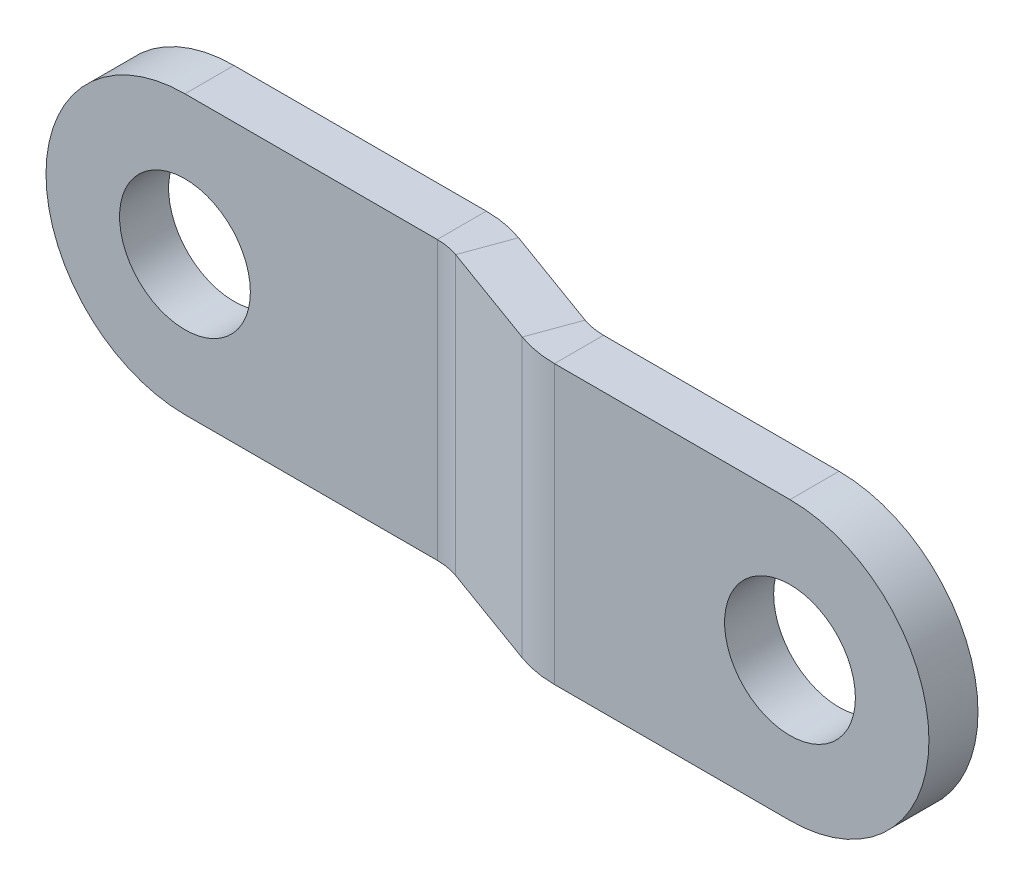
ISO-10303-21;
HEADER;
FILE_DESCRIPTION(('STEP AP214'),'2;1');
FILE_NAME('part.step','',(''),(''),'','','');
FILE_SCHEMA(('AUTOMOTIVE_DESIGN { 1 0 10303 214 1 1 1 1 }'));
ENDSEC;
DATA;
#1=APPLICATION_CONTEXT('core data for automotive mechanical design processes');
#2=APPLICATION_PROTOCOL_DEFINITION('international standard','automotive_design',2000,#1);
#3=PRODUCT_CONTEXT('',#1,'mechanical');
#4=PRODUCT('Part','Part','',(#3));
#5=PRODUCT_RELATED_PRODUCT_CATEGORY('part','',(#4));
#6=PRODUCT_DEFINITION_FORMATION('','',#4);
#7=PRODUCT_DEFINITION_CONTEXT('part definition',#1,'design');
#8=PRODUCT_DEFINITION('design','',#6,#7);
#9=PRODUCT_DEFINITION_SHAPE('','',#8);
#10=(LENGTH_UNIT() NAMED_UNIT(*) SI_UNIT(.MILLI.,.METRE.));
#11=(NAMED_UNIT(*) PLANE_ANGLE_UNIT() SI_UNIT($,.RADIAN.));
#12=(NAMED_UNIT(*) SI_UNIT($,.STERADIAN.) SOLID_ANGLE_UNIT());
#13=UNCERTAINTY_MEASURE_WITH_UNIT(LENGTH_MEASURE(1.E-05),#10,'distance_accuracy_value','');
#14=(GEOMETRIC_REPRESENTATION_CONTEXT(3) GLOBAL_UNCERTAINTY_ASSIGNED_CONTEXT((#13)) GLOBAL_UNIT_ASSIGNED_CONTEXT((#10,
#11,#12)) REPRESENTATION_CONTEXT('',''));
#15=CARTESIAN_POINT('',(0.,0.,0.));
#16=DIRECTION('',(0.,0.,1.));
#17=DIRECTION('',(1.,0.,0.));
#18=AXIS2_PLACEMENT_3D('',#15,#16,#17);
#19=CARTESIAN_POINT('',(2.44409855070353,4.25,0.793312463355389));
#20=DIRECTION('',(0.,-1.,0.));
#21=DIRECTION('',(0.,0.,-1.));
#22=AXIS2_PLACEMENT_3D('',#19,#20,#21);
#23=PLANE('',#22);
#24=DIRECTION('',(0.,0.,1.));
#25=VECTOR('',#24,1.);
#26=CARTESIAN_POINT('',(10.,4.25,-2.20285139453435));
#27=LINE('',#26,#25);
#28=CARTESIAN_POINT('',(10.,4.25,-0.706687536644589));
#29=VERTEX_POINT('',#28);
#30=CARTESIAN_POINT('',(10.,4.25,0.793312463355372));
#31=VERTEX_POINT('',#30);
#32=EDGE_CURVE('E110',#29,#31,#27,.T.);
#33=ORIENTED_EDGE('',*,*,#32,.F.);
#34=DIRECTION('',(-1.,0.,0.));
#35=VECTOR('',#34,1.);
#36=CARTESIAN_POINT('',(2.44409855070354,4.25,-0.706687536644612));
#37=LINE('',#36,#35);
#38=CARTESIAN_POINT('',(2.79675251212046,4.25,-0.706687536644609));
#39=VERTEX_POINT('',#38);
#40=EDGE_CURVE('E175',#29,#39,#37,.T.);
#41=ORIENTED_EDGE('',*,*,#40,.T.);
#42=DIRECTION('',(0.,0.,1.));
#43=VECTOR('',#42,1.);
#44=CARTESIAN_POINT('',(2.79675251212047,4.25,-0.706687536644609));
#45=LINE('',#44,#43);
#46=CARTESIAN_POINT('',(2.79675251212044,4.25,0.793312463355391));
#47=VERTEX_POINT('',#46);
#48=EDGE_CURVE('E157',#39,#47,#45,.T.);
#49=ORIENTED_EDGE('',*,*,#48,.T.);
#50=DIRECTION('',(-1.,0.,0.));
#51=VECTOR('',#50,1.);
#52=CARTESIAN_POINT('',(2.44409855070353,4.25,0.793312463355389));
#53=LINE('',#52,#51);
#54=EDGE_CURVE('E174',#31,#47,#53,.T.);
#55=ORIENTED_EDGE('',*,*,#54,.F.);
#56=EDGE_LOOP('',(#33,#41,#49,#55));
#57=FACE_BOUND('',#56,.T.);
#58=ADVANCED_FACE('F16',(#57),#23,.F.);
#59=CARTESIAN_POINT('',(0.,0.,0.793312463355372));
#60=DIRECTION('',(0.,0.,-1.));
#61=DIRECTION('',(-1.,0.,0.));
#62=AXIS2_PLACEMENT_3D('',#59,#60,#61);
#63=PLANE('',#62);
#64=CARTESIAN_POINT('',(10.,0.,0.793312463355372));
#65=DIRECTION('',(0.,0.,1.));
#66=DIRECTION('',(1.,0.,0.));
#67=AXIS2_PLACEMENT_3D('',#64,#65,#66);
#68=CIRCLE('',#67,2.);
#69=CARTESIAN_POINT('',(12.,0.,0.793312463355372));
#70=VERTEX_POINT('',#69);
#71=EDGE_CURVE('E224',#70,#70,#68,.T.);
#72=ORIENTED_EDGE('',*,*,#71,.F.);
#73=EDGE_LOOP('',(#72));
#74=FACE_BOUND('',#73,.T.);
#75=CARTESIAN_POINT('',(10.,0.,0.793312463355372));
#76=DIRECTION('',(0.,0.,1.));
#77=DIRECTION('',(1.,0.,0.));
#78=AXIS2_PLACEMENT_3D('',#75,#76,#77);
#79=CIRCLE('',#78,4.25);
#80=CARTESIAN_POINT('',(10.,-4.25,0.793312463355372));
#81=VERTEX_POINT('',#80);
#82=EDGE_CURVE('E111',#81,#31,#79,.T.);
#83=ORIENTED_EDGE('',*,*,#82,.T.);
#84=ORIENTED_EDGE('',*,*,#54,.T.);
#85=DIRECTION('',(0.,1.,0.));
#86=VECTOR('',#85,1.);
#87=CARTESIAN_POINT('',(2.79675251212047,0.,0.793312463355391));
#88=LINE('',#87,#86);
#89=CARTESIAN_POINT('',(2.79675251212047,-4.25,0.793312463355391));
#90=VERTEX_POINT('',#89);
#91=EDGE_CURVE('E165',#90,#47,#88,.T.);
#92=ORIENTED_EDGE('',*,*,#91,.F.);
#93=DIRECTION('',(1.,0.,0.));
#94=VECTOR('',#93,1.);
#95=CARTESIAN_POINT('',(17.4440985507035,-4.25,0.79331246335549));
#96=LINE('',#95,#94);
#97=EDGE_CURVE('E171',#90,#81,#96,.T.);
#98=ORIENTED_EDGE('',*,*,#97,.T.);
#99=EDGE_LOOP('',(#83,#84,#92,#98));
#100=FACE_BOUND('',#99,.T.);
#101=ADVANCED_FACE('F248',(#74,#100),#63,.F.);
#102=CARTESIAN_POINT('',(0.,0.,-0.706687536644628));
#103=DIRECTION('',(0.,0.,-1.));
#104=DIRECTION('',(-1.,0.,0.));
#105=AXIS2_PLACEMENT_3D('',#102,#103,#104);
#106=PLANE('',#105);
#107=CARTESIAN_POINT('',(10.,0.,-0.706687536644561));
#108=DIRECTION('',(0.,0.,-1.));
#109=DIRECTION('',(-1.,0.,0.));
#110=AXIS2_PLACEMENT_3D('',#107,#108,#109);
#111=CIRCLE('',#110,2.);
#112=CARTESIAN_POINT('',(8.,0.,-0.706687536644575));
#113=VERTEX_POINT('',#112);
#114=EDGE_CURVE('E20',#113,#113,#111,.T.);
#115=ORIENTED_EDGE('',*,*,#114,.F.);
#116=EDGE_LOOP('',(#115));
#117=FACE_BOUND('',#116,.T.);
#118=ORIENTED_EDGE('',*,*,#40,.F.);
#119=CARTESIAN_POINT('',(10.,0.,-0.706687536644561));
#120=DIRECTION('',(0.,0.,-1.));
#121=DIRECTION('',(-1.,0.,0.));
#122=AXIS2_PLACEMENT_3D('',#119,#120,#121);
#123=CIRCLE('',#122,4.25);
#124=CARTESIAN_POINT('',(10.,-4.25,-0.706687536644561));
#125=VERTEX_POINT('',#124);
#126=EDGE_CURVE('E10',#29,#125,#123,.T.);
#127=ORIENTED_EDGE('',*,*,#126,.T.);
#128=DIRECTION('',(1.,0.,0.));
#129=VECTOR('',#128,1.);
#130=CARTESIAN_POINT('',(17.4440985507035,-4.25,-0.70668753664451));
#131=LINE('',#130,#129);
#132=CARTESIAN_POINT('',(2.79675251212046,-4.25,-0.706687536644609));
#133=VERTEX_POINT('',#132);
#134=EDGE_CURVE('E170',#133,#125,#131,.T.);
#135=ORIENTED_EDGE('',*,*,#134,.F.);
#136=DIRECTION('',(0.,-1.,0.));
#137=VECTOR('',#136,1.);
#138=CARTESIAN_POINT('',(2.79675251212047,4.25,-0.706687536644609));
#139=LINE('',#138,#137);
#140=EDGE_CURVE('E160',#39,#133,#139,.T.);
#141=ORIENTED_EDGE('',*,*,#140,.F.);
#142=EDGE_LOOP('',(#118,#127,#135,#141));
#143=FACE_BOUND('',#142,.T.);
#144=ADVANCED_FACE('F245',(#117,#143),#106,.T.);
#145=CARTESIAN_POINT('',(-16.9310683357151,-4.25,-2.20285139453435));
#146=DIRECTION('',(0.,1.,0.));
#147=DIRECTION('',(0.,0.,1.));
#148=AXIS2_PLACEMENT_3D('',#145,#146,#147);
#149=PLANE('',#148);
#150=DIRECTION('',(0.,0.,1.));
#151=VECTOR('',#150,1.);
#152=CARTESIAN_POINT('',(-10.,-4.25,-2.20285139453435));
#153=LINE('',#152,#151);
#154=CARTESIAN_POINT('',(-10.,-4.25,-2.20285139453435));
#155=VERTEX_POINT('',#154);
#156=CARTESIAN_POINT('',(-10.,-4.25,-0.702851394534305));
#157=VERTEX_POINT('',#156);
#158=EDGE_CURVE('E39',#155,#157,#153,.T.);
#159=ORIENTED_EDGE('',*,*,#158,.F.);
#160=DIRECTION('',(-1.,0.,0.));
#161=VECTOR('',#160,1.);
#162=CARTESIAN_POINT('',(-16.9310683357151,-4.25,-2.20285139453435));
#163=LINE('',#162,#161);
#164=CARTESIAN_POINT('',(-2.28372229713196,-4.25,-2.20285139453425));
#165=VERTEX_POINT('',#164);
#166=EDGE_CURVE('E118',#165,#155,#163,.T.);
#167=ORIENTED_EDGE('',*,*,#166,.F.);
#168=DIRECTION('',(0.,0.,-1.));
#169=VECTOR('',#168,1.);
#170=CARTESIAN_POINT('',(-2.28372229713196,-4.25,-0.702851394534253));
#171=LINE('',#170,#169);
#172=CARTESIAN_POINT('',(-2.28372229713195,-4.25,-0.702851394534253));
#173=VERTEX_POINT('',#172);
#174=EDGE_CURVE('E236',#173,#165,#171,.T.);
#175=ORIENTED_EDGE('',*,*,#174,.F.);
#176=DIRECTION('',(-1.,0.,0.));
#177=VECTOR('',#176,1.);
#178=CARTESIAN_POINT('',(-16.9310683357151,-4.25,-0.702851394534352));
#179=LINE('',#178,#177);
#180=EDGE_CURVE('E120',#173,#157,#179,.T.);
#181=ORIENTED_EDGE('',*,*,#180,.T.);
#182=EDGE_LOOP('',(#159,#167,#175,#181));
#183=FACE_BOUND('',#182,.T.);
#184=ADVANCED_FACE('F116',(#183),#149,.F.);
#185=CARTESIAN_POINT('',(0.,0.,-2.20285139453423));
#186=DIRECTION('',(0.,0.,1.));
#187=DIRECTION('',(1.,0.,0.));
#188=AXIS2_PLACEMENT_3D('',#185,#186,#187);
#189=PLANE('',#188);
#190=CARTESIAN_POINT('',(-10.,0.,-2.20285139453435));
#191=DIRECTION('',(0.,0.,1.));
#192=DIRECTION('',(1.,0.,0.));
#193=AXIS2_PLACEMENT_3D('',#190,#191,#192);
#194=CIRCLE('',#193,2.);
#195=CARTESIAN_POINT('',(-8.,0.,-2.20285139453435));
#196=VERTEX_POINT('',#195);
#197=EDGE_CURVE('E215',#196,#196,#194,.T.);
#198=ORIENTED_EDGE('',*,*,#197,.T.);
#199=EDGE_LOOP('',(#198));
#200=FACE_BOUND('',#199,.T.);
#201=CARTESIAN_POINT('',(-10.,0.,-2.20285139453435));
#202=DIRECTION('',(0.,0.,1.));
#203=DIRECTION('',(1.,0.,0.));
#204=AXIS2_PLACEMENT_3D('',#201,#202,#203);
#205=CIRCLE('',#204,4.25);
#206=CARTESIAN_POINT('',(-10.,4.25,-2.20285139453435));
#207=VERTEX_POINT('',#206);
#208=EDGE_CURVE('E103',#207,#155,#205,.T.);
#209=ORIENTED_EDGE('',*,*,#208,.F.);
#210=DIRECTION('',(1.,0.,0.));
#211=VECTOR('',#210,1.);
#212=CARTESIAN_POINT('',(-1.93106833571503,4.25,-2.20285139453425));
#213=LINE('',#212,#211);
#214=CARTESIAN_POINT('',(-2.28372229713194,4.25,-2.20285139453425));
#215=VERTEX_POINT('',#214);
#216=EDGE_CURVE('E126',#207,#215,#213,.T.);
#217=ORIENTED_EDGE('',*,*,#216,.T.);
#218=DIRECTION('',(0.,1.,0.));
#219=VECTOR('',#218,1.);
#220=CARTESIAN_POINT('',(-2.28372229713196,0.,-2.20285139453425));
#221=LINE('',#220,#219);
#222=EDGE_CURVE('E125',#165,#215,#221,.T.);
#223=ORIENTED_EDGE('',*,*,#222,.F.);
#224=ORIENTED_EDGE('',*,*,#166,.T.);
#225=EDGE_LOOP('',(#209,#217,#223,#224));
#226=FACE_BOUND('',#225,.T.);
#227=ADVANCED_FACE('F123',(#200,#226),#189,.F.);
#228=CARTESIAN_POINT('',(0.,0.,-0.702851394534238));
#229=DIRECTION('',(0.,0.,1.));
#230=DIRECTION('',(1.,0.,0.));
#231=AXIS2_PLACEMENT_3D('',#228,#229,#230);
#232=PLANE('',#231);
#233=CARTESIAN_POINT('',(-10.,0.,-0.702851394534305));
#234=DIRECTION('',(0.,0.,1.));
#235=DIRECTION('',(1.,0.,0.));
#236=AXIS2_PLACEMENT_3D('',#233,#234,#235);
#237=CIRCLE('',#236,2.);
#238=CARTESIAN_POINT('',(-8.,0.,-0.702851394534292));
#239=VERTEX_POINT('',#238);
#240=EDGE_CURVE('E212',#239,#239,#237,.T.);
#241=ORIENTED_EDGE('',*,*,#240,.F.);
#242=EDGE_LOOP('',(#241));
#243=FACE_BOUND('',#242,.T.);
#244=DIRECTION('',(1.,0.,0.));
#245=VECTOR('',#244,1.);
#246=CARTESIAN_POINT('',(-1.93106833571504,4.25,-0.702851394534251));
#247=LINE('',#246,#245);
#248=CARTESIAN_POINT('',(-10.,4.25,-0.702851394534276));
#249=VERTEX_POINT('',#248);
#250=CARTESIAN_POINT('',(-2.28372229713195,4.25,-0.702851394534253));
#251=VERTEX_POINT('',#250);
#252=EDGE_CURVE('E127',#249,#251,#247,.T.);
#253=ORIENTED_EDGE('',*,*,#252,.F.);
#254=CARTESIAN_POINT('',(-10.,0.,-0.702851394534305));
#255=DIRECTION('',(0.,0.,1.));
#256=DIRECTION('',(1.,0.,0.));
#257=AXIS2_PLACEMENT_3D('',#254,#255,#256);
#258=CIRCLE('',#257,4.25);
#259=EDGE_CURVE('E25',#249,#157,#258,.T.);
#260=ORIENTED_EDGE('',*,*,#259,.T.);
#261=ORIENTED_EDGE('',*,*,#180,.F.);
#262=DIRECTION('',(0.,-1.,0.));
#263=VECTOR('',#262,1.);
#264=CARTESIAN_POINT('',(-2.28372229713196,4.25,-0.702851394534253));
#265=LINE('',#264,#263);
#266=EDGE_CURVE('E234',#251,#173,#265,.T.);
#267=ORIENTED_EDGE('',*,*,#266,.F.);
#268=EDGE_LOOP('',(#253,#260,#261,#267));
#269=FACE_BOUND('',#268,.T.);
#270=ADVANCED_FACE('F218',(#243,#269),#232,.T.);
#271=CARTESIAN_POINT('',(-1.41803812072654,-4.25,-2.11239032571311));
#272=DIRECTION('',(0.,-1.,0.));
#273=DIRECTION('',(0.,0.,-1.));
#274=AXIS2_PLACEMENT_3D('',#271,#272,#273);
#275=PLANE('',#274);
#276=DIRECTION('',(0.939692620785908,0.,0.342020143325669));
#277=VECTOR('',#276,1.);
#278=CARTESIAN_POINT('',(-1.93106833571504,-4.25,-0.702851394534251));
#279=LINE('',#278,#277);
#280=CARTESIAN_POINT('',(-1.59968201048064,-4.25,-0.582236636106069));
#281=VERTEX_POINT('',#280);
#282=CARTESIAN_POINT('',(1.59968201048064,-4.25,0.582236636106071));
#283=VERTEX_POINT('',#282);
#284=EDGE_CURVE('E201',#281,#283,#279,.T.);
#285=ORIENTED_EDGE('',*,*,#284,.F.);
#286=DIRECTION('',(0.342020143325669,0.,-0.939692620785908));
#287=VECTOR('',#286,1.);
#288=CARTESIAN_POINT('',(-1.59968201048064,-4.25,-0.582236636106072));
#289=LINE('',#288,#287);
#290=CARTESIAN_POINT('',(-1.08665179549213,-4.25,-1.99177556728493));
#291=VERTEX_POINT('',#290);
#292=EDGE_CURVE('E143',#281,#291,#289,.T.);
#293=ORIENTED_EDGE('',*,*,#292,.T.);
#294=DIRECTION('',(0.939692620785908,0.,0.342020143325669));
#295=VECTOR('',#294,1.);
#296=CARTESIAN_POINT('',(-1.41803812072654,-4.25,-2.11239032571311));
#297=LINE('',#296,#295);
#298=CARTESIAN_POINT('',(2.11271222546915,-4.25,-0.827302295072791));
#299=VERTEX_POINT('',#298);
#300=EDGE_CURVE('E204',#291,#299,#297,.T.);
#301=ORIENTED_EDGE('',*,*,#300,.T.);
#302=DIRECTION('',(-0.342020143325669,0.,0.939692620785908));
#303=VECTOR('',#302,1.);
#304=CARTESIAN_POINT('',(2.11271222546915,-4.25,-0.827302295072791));
#305=LINE('',#304,#303);
#306=EDGE_CURVE('E188',#299,#283,#305,.T.);
#307=ORIENTED_EDGE('',*,*,#306,.T.);
#308=EDGE_LOOP('',(#285,#293,#301,#307));
#309=FACE_BOUND('',#308,.T.);
#310=ADVANCED_FACE('F18',(#309),#275,.T.);
#311=CARTESIAN_POINT('',(0.513030214988504,0.,-1.40953893117886));
#312=DIRECTION('',(-0.342020143325669,0.,0.939692620785908));
#313=DIRECTION('',(0.939692620785908,0.,0.342020143325669));
#314=AXIS2_PLACEMENT_3D('',#311,#312,#313);
#315=PLANE('',#314);
#316=DIRECTION('',(0.,-1.,0.));
#317=VECTOR('',#316,1.);
#318=CARTESIAN_POINT('',(-1.08665179549213,-4.25,-1.99177556728493));
#319=LINE('',#318,#317);
#320=CARTESIAN_POINT('',(-1.08665179549214,4.25,-1.99177556728493));
#321=VERTEX_POINT('',#320);
#322=EDGE_CURVE('E136',#291,#321,#319,.F.);
#323=ORIENTED_EDGE('',*,*,#322,.T.);
#324=DIRECTION('',(-0.939692620785908,0.,-0.342020143325669));
#325=VECTOR('',#324,1.);
#326=CARTESIAN_POINT('',(-1.41803812072654,4.25,-2.11239032571311));
#327=LINE('',#326,#325);
#328=CARTESIAN_POINT('',(2.11271222546915,4.25,-0.827302295072791));
#329=VERTEX_POINT('',#328);
#330=EDGE_CURVE('E206',#329,#321,#327,.T.);
#331=ORIENTED_EDGE('',*,*,#330,.F.);
#332=DIRECTION('',(0.,-1.,0.));
#333=VECTOR('',#332,1.);
#334=CARTESIAN_POINT('',(2.11271222546915,-4.25,-0.827302295072791));
#335=LINE('',#334,#333);
#336=EDGE_CURVE('E194',#299,#329,#335,.F.);
#337=ORIENTED_EDGE('',*,*,#336,.F.);
#338=ORIENTED_EDGE('',*,*,#300,.F.);
#339=EDGE_LOOP('',(#323,#331,#337,#338));
#340=FACE_BOUND('',#339,.T.);
#341=ADVANCED_FACE('F267',(#340),#315,.F.);
#342=CARTESIAN_POINT('',(0.,0.,0.));
#343=DIRECTION('',(-0.342020143325669,0.,0.939692620785908));
#344=DIRECTION('',(0.939692620785908,0.,0.342020143325669));
#345=AXIS2_PLACEMENT_3D('',#342,#343,#344);
#346=PLANE('',#345);
#347=DIRECTION('',(-0.939692620785908,0.,-0.342020143325669));
#348=VECTOR('',#347,1.);
#349=CARTESIAN_POINT('',(-1.93106833571504,4.25,-0.702851394534251));
#350=LINE('',#349,#348);
#351=CARTESIAN_POINT('',(1.59968201048064,4.25,0.582236636106069));
#352=VERTEX_POINT('',#351);
#353=CARTESIAN_POINT('',(-1.59968201048064,4.25,-0.582236636106069));
#354=VERTEX_POINT('',#353);
#355=EDGE_CURVE('E207',#352,#354,#350,.T.);
#356=ORIENTED_EDGE('',*,*,#355,.T.);
#357=DIRECTION('',(0.,-1.,0.));
#358=VECTOR('',#357,1.);
#359=CARTESIAN_POINT('',(-1.59968201048064,-4.25,-0.582236636106072));
#360=LINE('',#359,#358);
#361=EDGE_CURVE('E149',#281,#354,#360,.F.);
#362=ORIENTED_EDGE('',*,*,#361,.F.);
#363=ORIENTED_EDGE('',*,*,#284,.T.);
#364=DIRECTION('',(0.,-1.,0.));
#365=VECTOR('',#364,1.);
#366=CARTESIAN_POINT('',(1.59968201048064,-4.25,0.582236636106071));
#367=LINE('',#366,#365);
#368=EDGE_CURVE('E181',#283,#352,#367,.F.);
#369=ORIENTED_EDGE('',*,*,#368,.T.);
#370=EDGE_LOOP('',(#356,#362,#363,#369));
#371=FACE_BOUND('',#370,.T.);
#372=ADVANCED_FACE('F274',(#371),#346,.T.);
#373=CARTESIAN_POINT('',(-1.41803812072654,4.25,-2.11239032571311));
#374=DIRECTION('',(0.,1.,0.));
#375=DIRECTION('',(0.,0.,1.));
#376=AXIS2_PLACEMENT_3D('',#373,#374,#375);
#377=PLANE('',#376);
#378=DIRECTION('',(0.342020143325669,0.,-0.939692620785908));
#379=VECTOR('',#378,1.);
#380=CARTESIAN_POINT('',(-1.59968201048064,4.25,-0.582236636106072));
#381=LINE('',#380,#379);
#382=EDGE_CURVE('E154',#354,#321,#381,.T.);
#383=ORIENTED_EDGE('',*,*,#382,.F.);
#384=ORIENTED_EDGE('',*,*,#355,.F.);
#385=DIRECTION('',(-0.342020143325669,0.,0.939692620785908));
#386=VECTOR('',#385,1.);
#387=CARTESIAN_POINT('',(2.11271222546915,4.25,-0.827302295072791));
#388=LINE('',#387,#386);
#389=EDGE_CURVE('E198',#329,#352,#388,.T.);
#390=ORIENTED_EDGE('',*,*,#389,.F.);
#391=ORIENTED_EDGE('',*,*,#330,.T.);
#392=EDGE_LOOP('',(#383,#384,#390,#391));
#393=FACE_BOUND('',#392,.T.);
#394=ADVANCED_FACE('F270',(#393),#377,.T.);
#395=CARTESIAN_POINT('',(2.79675251212047,4.25,-2.70668753664458));
#396=DIRECTION('',(0.,1.,0.));
#397=DIRECTION('',(0.,0.,1.));
#398=AXIS2_PLACEMENT_3D('',#395,#396,#397);
#399=PLANE('',#398);
#400=ORIENTED_EDGE('',*,*,#48,.F.);
#401=CARTESIAN_POINT('',(2.79675251212047,4.25,-2.70668753664458));
#402=DIRECTION('',(0.,-1.,0.));
#403=DIRECTION('',(0.,0.,-1.));
#404=AXIS2_PLACEMENT_3D('',#401,#402,#403);
#405=CIRCLE('',#404,1.99999999999996);
#406=EDGE_CURVE('E191',#329,#39,#405,.F.);
#407=ORIENTED_EDGE('',*,*,#406,.F.);
#408=ORIENTED_EDGE('',*,*,#389,.T.);
#409=CARTESIAN_POINT('',(2.79675251212047,4.25,-2.70668753664458));
#410=DIRECTION('',(0.,-1.,0.));
#411=DIRECTION('',(0.,0.,-1.));
#412=AXIS2_PLACEMENT_3D('',#409,#410,#411);
#413=CIRCLE('',#412,3.49999999999996);
#414=EDGE_CURVE('E184',#352,#47,#413,.F.);
#415=ORIENTED_EDGE('',*,*,#414,.T.);
#416=EDGE_LOOP('',(#400,#407,#408,#415));
#417=FACE_BOUND('',#416,.T.);
#418=ADVANCED_FACE('F259',(#417),#399,.T.);
#419=CARTESIAN_POINT('',(2.79675251212047,-4.25,-2.70668753664458));
#420=DIRECTION('',(0.,1.,0.));
#421=DIRECTION('',(0.,0.,1.));
#422=AXIS2_PLACEMENT_3D('',#419,#420,#421);
#423=PLANE('',#422);
#424=CARTESIAN_POINT('',(2.79675251212047,-4.25,-2.70668753664458));
#425=DIRECTION('',(0.,-1.,0.));
#426=DIRECTION('',(0.,0.,-1.));
#427=AXIS2_PLACEMENT_3D('',#424,#425,#426);
#428=CIRCLE('',#427,1.99999999999996);
#429=EDGE_CURVE('E177',#133,#299,#428,.T.);
#430=ORIENTED_EDGE('',*,*,#429,.F.);
#431=DIRECTION('',(0.,0.,1.));
#432=VECTOR('',#431,1.);
#433=CARTESIAN_POINT('',(2.79675251212047,-4.25,-0.706687536644609));
#434=LINE('',#433,#432);
#435=EDGE_CURVE('E162',#133,#90,#434,.T.);
#436=ORIENTED_EDGE('',*,*,#435,.T.);
#437=CARTESIAN_POINT('',(2.79675251212047,-4.25,-2.70668753664458));
#438=DIRECTION('',(0.,-1.,0.));
#439=DIRECTION('',(0.,0.,-1.));
#440=AXIS2_PLACEMENT_3D('',#437,#438,#439);
#441=CIRCLE('',#440,3.49999999999996);
#442=EDGE_CURVE('E185',#90,#283,#441,.T.);
#443=ORIENTED_EDGE('',*,*,#442,.T.);
#444=ORIENTED_EDGE('',*,*,#306,.F.);
#445=EDGE_LOOP('',(#430,#436,#443,#444));
#446=FACE_BOUND('',#445,.T.);
#447=ADVANCED_FACE('F280',(#446),#423,.F.);
#448=CARTESIAN_POINT('',(2.79675251212047,-4.25,-2.70668753664458));
#449=DIRECTION('',(0.,-1.,0.));
#450=DIRECTION('',(0.,0.,1.));
#451=AXIS2_PLACEMENT_3D('',#448,#449,#450);
#452=CYLINDRICAL_SURFACE('',#451,3.49999999999996);
#453=ORIENTED_EDGE('',*,*,#368,.F.);
#454=ORIENTED_EDGE('',*,*,#442,.F.);
#455=ORIENTED_EDGE('',*,*,#91,.T.);
#456=ORIENTED_EDGE('',*,*,#414,.F.);
#457=EDGE_LOOP('',(#453,#454,#455,#456));
#458=FACE_BOUND('',#457,.T.);
#459=ADVANCED_FACE('F277',(#458),#452,.T.);
#460=CARTESIAN_POINT('',(2.79675251212047,-4.25,-2.70668753664458));
#461=DIRECTION('',(0.,-1.,0.));
#462=DIRECTION('',(0.,0.,1.));
#463=AXIS2_PLACEMENT_3D('',#460,#461,#462);
#464=CYLINDRICAL_SURFACE('',#463,1.99999999999996);
#465=ORIENTED_EDGE('',*,*,#336,.T.);
#466=ORIENTED_EDGE('',*,*,#406,.T.);
#467=ORIENTED_EDGE('',*,*,#140,.T.);
#468=ORIENTED_EDGE('',*,*,#429,.T.);
#469=EDGE_LOOP('',(#465,#466,#467,#468));
#470=FACE_BOUND('',#469,.T.);
#471=ADVANCED_FACE('F262',(#470),#464,.F.);
#472=CARTESIAN_POINT('',(17.4440985507035,-4.25,0.79331246335549));
#473=DIRECTION('',(0.,1.,0.));
#474=DIRECTION('',(0.,0.,1.));
#475=AXIS2_PLACEMENT_3D('',#472,#473,#474);
#476=PLANE('',#475);
#477=ORIENTED_EDGE('',*,*,#134,.T.);
#478=DIRECTION('',(0.,0.,1.));
#479=VECTOR('',#478,1.);
#480=CARTESIAN_POINT('',(10.,-4.25,-2.20285139453435));
#481=LINE('',#480,#479);
#482=EDGE_CURVE('E32',#125,#81,#481,.T.);
#483=ORIENTED_EDGE('',*,*,#482,.T.);
#484=ORIENTED_EDGE('',*,*,#97,.F.);
#485=ORIENTED_EDGE('',*,*,#435,.F.);
#486=EDGE_LOOP('',(#477,#483,#484,#485));
#487=FACE_BOUND('',#486,.T.);
#488=ADVANCED_FACE('F297',(#487),#476,.F.);
#489=CARTESIAN_POINT('',(-2.28372229713196,4.25,1.29714860546571));
#490=DIRECTION('',(0.,1.,0.));
#491=DIRECTION('',(0.,0.,1.));
#492=AXIS2_PLACEMENT_3D('',#489,#490,#491);
#493=PLANE('',#492);
#494=DIRECTION('',(0.,0.,-1.));
#495=VECTOR('',#494,1.);
#496=CARTESIAN_POINT('',(-2.28372229713196,4.25,-0.702851394534253));
#497=LINE('',#496,#495);
#498=EDGE_CURVE('E237',#251,#215,#497,.T.);
#499=ORIENTED_EDGE('',*,*,#498,.F.);
#500=CARTESIAN_POINT('',(-2.28372229713196,4.25,1.29714860546571));
#501=DIRECTION('',(0.,-1.,0.));
#502=DIRECTION('',(0.,0.,-1.));
#503=AXIS2_PLACEMENT_3D('',#500,#501,#502);
#504=CIRCLE('',#503,1.99999999999996);
#505=EDGE_CURVE('E146',#354,#251,#504,.F.);
#506=ORIENTED_EDGE('',*,*,#505,.F.);
#507=ORIENTED_EDGE('',*,*,#382,.T.);
#508=CARTESIAN_POINT('',(-2.28372229713196,4.25,1.29714860546571));
#509=DIRECTION('',(0.,-1.,0.));
#510=DIRECTION('',(0.,0.,-1.));
#511=AXIS2_PLACEMENT_3D('',#508,#509,#510);
#512=CIRCLE('',#511,3.49999999999996);
#513=EDGE_CURVE('E139',#321,#215,#512,.F.);
#514=ORIENTED_EDGE('',*,*,#513,.T.);
#515=EDGE_LOOP('',(#499,#506,#507,#514));
#516=FACE_BOUND('',#515,.T.);
#517=ADVANCED_FACE('F295',(#516),#493,.T.);
#518=CARTESIAN_POINT('',(-2.28372229713196,-4.25,1.29714860546571));
#519=DIRECTION('',(0.,1.,0.));
#520=DIRECTION('',(0.,0.,1.));
#521=AXIS2_PLACEMENT_3D('',#518,#519,#520);
#522=PLANE('',#521);
#523=CARTESIAN_POINT('',(-2.28372229713196,-4.25,1.29714860546571));
#524=DIRECTION('',(0.,-1.,0.));
#525=DIRECTION('',(0.,0.,-1.));
#526=AXIS2_PLACEMENT_3D('',#523,#524,#525);
#527=CIRCLE('',#526,1.99999999999996);
#528=EDGE_CURVE('E129',#173,#281,#527,.T.);
#529=ORIENTED_EDGE('',*,*,#528,.F.);
#530=ORIENTED_EDGE('',*,*,#174,.T.);
#531=CARTESIAN_POINT('',(-2.28372229713196,-4.25,1.29714860546571));
#532=DIRECTION('',(0.,-1.,0.));
#533=DIRECTION('',(0.,0.,-1.));
#534=AXIS2_PLACEMENT_3D('',#531,#532,#533);
#535=CIRCLE('',#534,3.49999999999996);
#536=EDGE_CURVE('E140',#165,#291,#535,.T.);
#537=ORIENTED_EDGE('',*,*,#536,.T.);
#538=ORIENTED_EDGE('',*,*,#292,.F.);
#539=EDGE_LOOP('',(#529,#530,#537,#538));
#540=FACE_BOUND('',#539,.T.);
#541=ADVANCED_FACE('F290',(#540),#522,.F.);
#542=CARTESIAN_POINT('',(-2.28372229713196,-4.25,1.29714860546571));
#543=DIRECTION('',(0.,-1.,0.));
#544=DIRECTION('',(0.,0.,-1.));
#545=AXIS2_PLACEMENT_3D('',#542,#543,#544);
#546=CYLINDRICAL_SURFACE('',#545,3.49999999999996);
#547=ORIENTED_EDGE('',*,*,#322,.F.);
#548=ORIENTED_EDGE('',*,*,#536,.F.);
#549=ORIENTED_EDGE('',*,*,#222,.T.);
#550=ORIENTED_EDGE('',*,*,#513,.F.);
#551=EDGE_LOOP('',(#547,#548,#549,#550));
#552=FACE_BOUND('',#551,.T.);
#553=ADVANCED_FACE('F289',(#552),#546,.T.);
#554=CARTESIAN_POINT('',(-2.28372229713196,-4.25,1.29714860546571));
#555=DIRECTION('',(0.,-1.,0.));
#556=DIRECTION('',(0.,0.,-1.));
#557=AXIS2_PLACEMENT_3D('',#554,#555,#556);
#558=CYLINDRICAL_SURFACE('',#557,1.99999999999996);
#559=ORIENTED_EDGE('',*,*,#361,.T.);
#560=ORIENTED_EDGE('',*,*,#505,.T.);
#561=ORIENTED_EDGE('',*,*,#266,.T.);
#562=ORIENTED_EDGE('',*,*,#528,.T.);
#563=EDGE_LOOP('',(#559,#560,#561,#562));
#564=FACE_BOUND('',#563,.T.);
#565=ADVANCED_FACE('F292',(#564),#558,.F.);
#566=CARTESIAN_POINT('',(-1.93106833571503,4.25,-2.20285139453425));
#567=DIRECTION('',(0.,-1.,0.));
#568=DIRECTION('',(0.,0.,-1.));
#569=AXIS2_PLACEMENT_3D('',#566,#567,#568);
#570=PLANE('',#569);
#571=ORIENTED_EDGE('',*,*,#216,.F.);
#572=DIRECTION('',(0.,0.,1.));
#573=VECTOR('',#572,1.);
#574=CARTESIAN_POINT('',(-10.,4.25,-2.20285139453435));
#575=LINE('',#574,#573);
#576=EDGE_CURVE('E106',#207,#249,#575,.T.);
#577=ORIENTED_EDGE('',*,*,#576,.T.);
#578=ORIENTED_EDGE('',*,*,#252,.T.);
#579=ORIENTED_EDGE('',*,*,#498,.T.);
#580=EDGE_LOOP('',(#571,#577,#578,#579));
#581=FACE_BOUND('',#580,.T.);
#582=ADVANCED_FACE('F221',(#581),#570,.F.);
#583=CARTESIAN_POINT('',(-10.,0.,-2.20285139453435));
#584=DIRECTION('',(0.,0.,1.));
#585=DIRECTION('',(1.,0.,0.));
#586=AXIS2_PLACEMENT_3D('',#583,#584,#585);
#587=CYLINDRICAL_SURFACE('',#586,2.);
#588=ORIENTED_EDGE('',*,*,#240,.T.);
#589=EDGE_LOOP('',(#588));
#590=FACE_BOUND('',#589,.T.);
#591=ORIENTED_EDGE('',*,*,#197,.F.);
#592=EDGE_LOOP('',(#591));
#593=FACE_BOUND('',#592,.T.);
#594=ADVANCED_FACE('F401',(#590,#593),#587,.F.);
#595=CARTESIAN_POINT('',(-10.,0.,-2.20285139453435));
#596=DIRECTION('',(0.,0.,1.));
#597=DIRECTION('',(1.,0.,0.));
#598=AXIS2_PLACEMENT_3D('',#595,#596,#597);
#599=CYLINDRICAL_SURFACE('',#598,4.25);
#600=ORIENTED_EDGE('',*,*,#576,.F.);
#601=ORIENTED_EDGE('',*,*,#208,.T.);
#602=ORIENTED_EDGE('',*,*,#158,.T.);
#603=ORIENTED_EDGE('',*,*,#259,.F.);
#604=EDGE_LOOP('',(#600,#601,#602,#603));
#605=FACE_BOUND('',#604,.T.);
#606=ADVANCED_FACE('F104',(#605),#599,.T.);
#607=CARTESIAN_POINT('',(10.,0.,-2.20285139453435));
#608=DIRECTION('',(0.,0.,1.));
#609=DIRECTION('',(1.,0.,0.));
#610=AXIS2_PLACEMENT_3D('',#607,#608,#609);
#611=CYLINDRICAL_SURFACE('',#610,4.25);
#612=ORIENTED_EDGE('',*,*,#32,.T.);
#613=ORIENTED_EDGE('',*,*,#82,.F.);
#614=ORIENTED_EDGE('',*,*,#482,.F.);
#615=ORIENTED_EDGE('',*,*,#126,.F.);
#616=EDGE_LOOP('',(#612,#613,#614,#615));
#617=FACE_BOUND('',#616,.T.);
#618=ADVANCED_FACE('F421',(#617),#611,.T.);
#619=CARTESIAN_POINT('',(10.,0.,-2.20285139453435));
#620=DIRECTION('',(0.,0.,1.));
#621=DIRECTION('',(1.,0.,0.));
#622=AXIS2_PLACEMENT_3D('',#619,#620,#621);
#623=CYLINDRICAL_SURFACE('',#622,2.);
#624=ORIENTED_EDGE('',*,*,#114,.T.);
#625=EDGE_LOOP('',(#624));
#626=FACE_BOUND('',#625,.T.);
#627=ORIENTED_EDGE('',*,*,#71,.T.);
#628=EDGE_LOOP('',(#627));
#629=FACE_BOUND('',#628,.T.);
#630=ADVANCED_FACE('F242',(#626,#629),#623,.F.);
#631=CLOSED_SHELL('',(#58,#101,#144,#184,#227,#270,#310,#341,#372,#394,#418,#447,#459,#471,#488,
#517,#541,#553,#565,#582,#594,#606,#618,#630));
#632=MANIFOLD_SOLID_BREP('B1',#631);
#633=ADVANCED_BREP_SHAPE_REPRESENTATION('',(#18,#632),#14);
#634=SHAPE_DEFINITION_REPRESENTATION(#9,#633);
ENDSEC;
END-ISO-10303-21;
